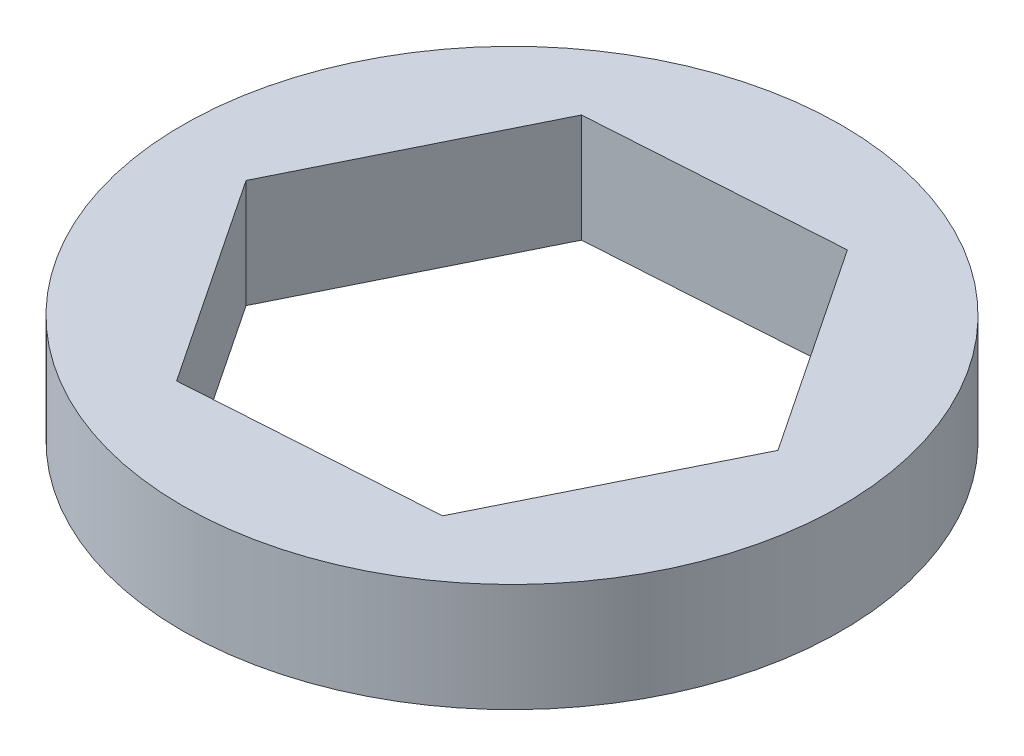
ISO-10303-21;
HEADER;
FILE_DESCRIPTION(('STEP AP214'),'2;1');
FILE_NAME('part.step','',(''),(''),'','','');
FILE_SCHEMA(('AUTOMOTIVE_DESIGN { 1 0 10303 214 1 1 1 1 }'));
ENDSEC;
DATA;
#1=APPLICATION_CONTEXT('core data for automotive mechanical design processes');
#2=APPLICATION_PROTOCOL_DEFINITION('international standard','automotive_design',2000,#1);
#3=PRODUCT_CONTEXT('',#1,'mechanical');
#4=PRODUCT('Part','Part','',(#3));
#5=PRODUCT_RELATED_PRODUCT_CATEGORY('part','',(#4));
#6=PRODUCT_DEFINITION_FORMATION('','',#4);
#7=PRODUCT_DEFINITION_CONTEXT('part definition',#1,'design');
#8=PRODUCT_DEFINITION('design','',#6,#7);
#9=PRODUCT_DEFINITION_SHAPE('','',#8);
#10=(LENGTH_UNIT() NAMED_UNIT(*) SI_UNIT(.MILLI.,.METRE.));
#11=(NAMED_UNIT(*) PLANE_ANGLE_UNIT() SI_UNIT($,.RADIAN.));
#12=(NAMED_UNIT(*) SI_UNIT($,.STERADIAN.) SOLID_ANGLE_UNIT());
#13=UNCERTAINTY_MEASURE_WITH_UNIT(LENGTH_MEASURE(1.E-05),#10,'distance_accuracy_value','');
#14=(GEOMETRIC_REPRESENTATION_CONTEXT(3) GLOBAL_UNCERTAINTY_ASSIGNED_CONTEXT((#13)) GLOBAL_UNIT_ASSIGNED_CONTEXT((#10,
#11,#12)) REPRESENTATION_CONTEXT('',''));
#15=CARTESIAN_POINT('',(0.,0.,0.));
#16=DIRECTION('',(0.,0.,1.));
#17=DIRECTION('',(1.,0.,0.));
#18=AXIS2_PLACEMENT_3D('',#15,#16,#17);
#19=CARTESIAN_POINT('',(0.,3.175,0.));
#20=DIRECTION('',(0.,1.,0.));
#21=DIRECTION('',(0.,0.,1.));
#22=AXIS2_PLACEMENT_3D('',#19,#20,#21);
#23=PLANE('',#22);
#24=CARTESIAN_POINT('',(0.,3.175,0.));
#25=DIRECTION('',(0.,1.,0.));
#26=DIRECTION('',(0.,0.,1.));
#27=AXIS2_PLACEMENT_3D('',#24,#25,#26);
#28=CIRCLE('',#27,9.652);
#29=CARTESIAN_POINT('',(0.,3.175,9.652));
#30=VERTEX_POINT('',#29);
#31=EDGE_CURVE('E11',#30,#30,#28,.T.);
#32=ORIENTED_EDGE('',*,*,#31,.T.);
#33=EDGE_LOOP('',(#32));
#34=FACE_BOUND('',#33,.T.);
#35=DIRECTION('',(0.443226594010271,0.,-0.896409608584186));
#36=VECTOR('',#35,1.);
#37=CARTESIAN_POINT('',(4.06725510664925,3.175,6.10088265997379));
#38=LINE('',#37,#36);
#39=CARTESIAN_POINT('',(4.06725510664925,3.175,6.10088265997379));
#40=VERTEX_POINT('',#39);
#41=CARTESIAN_POINT('',(7.31714692236991,3.175,-0.471904916043342));
#42=VERTEX_POINT('',#41);
#43=EDGE_CURVE('E96',#40,#42,#38,.T.);
#44=ORIENTED_EDGE('',*,*,#43,.F.);
#45=DIRECTION('',(0.997926790235506,0.,-0.064359314246346));
#46=VECTOR('',#45,1.);
#47=CARTESIAN_POINT('',(-3.24989181572066,3.175,6.57278757601714));
#48=LINE('',#47,#46);
#49=CARTESIAN_POINT('',(-3.24989181572066,3.175,6.57278757601714));
#50=VERTEX_POINT('',#49);
#51=EDGE_CURVE('E88',#50,#40,#48,.T.);
#52=ORIENTED_EDGE('',*,*,#51,.F.);
#53=DIRECTION('',(0.554700196225234,0.,0.83205029433784));
#54=VECTOR('',#53,1.);
#55=CARTESIAN_POINT('',(-7.31714692236991,3.175,0.471904916043342));
#56=LINE('',#55,#54);
#57=CARTESIAN_POINT('',(-7.31714692236991,3.175,0.471904916043343));
#58=VERTEX_POINT('',#57);
#59=EDGE_CURVE('E116',#58,#50,#56,.T.);
#60=ORIENTED_EDGE('',*,*,#59,.F.);
#61=DIRECTION('',(-0.443226594010272,0.,0.896409608584186));
#62=VECTOR('',#61,1.);
#63=CARTESIAN_POINT('',(-4.06725510664925,3.175,-6.10088265997379));
#64=LINE('',#63,#62);
#65=CARTESIAN_POINT('',(-4.06725510664925,3.175,-6.10088265997379));
#66=VERTEX_POINT('',#65);
#67=EDGE_CURVE('E114',#66,#58,#64,.T.);
#68=ORIENTED_EDGE('',*,*,#67,.F.);
#69=DIRECTION('',(-0.997926790235506,0.,0.0643593142463462));
#70=VECTOR('',#69,1.);
#71=CARTESIAN_POINT('',(3.24989181572066,3.175,-6.57278757601714));
#72=LINE('',#71,#70);
#73=CARTESIAN_POINT('',(3.24989181572066,3.175,-6.57278757601714));
#74=VERTEX_POINT('',#73);
#75=EDGE_CURVE('E110',#74,#66,#72,.T.);
#76=ORIENTED_EDGE('',*,*,#75,.F.);
#77=DIRECTION('',(-0.554700196225234,0.,-0.83205029433784));
#78=VECTOR('',#77,1.);
#79=CARTESIAN_POINT('',(7.31714692236991,3.175,-0.471904916043342));
#80=LINE('',#79,#78);
#81=EDGE_CURVE('E108',#42,#74,#80,.T.);
#82=ORIENTED_EDGE('',*,*,#81,.F.);
#83=EDGE_LOOP('',(#44,#52,#60,#68,#76,#82));
#84=FACE_BOUND('',#83,.T.);
#85=ADVANCED_FACE('F35',(#34,#84),#23,.T.);
#86=CARTESIAN_POINT('',(0.,0.,0.));
#87=DIRECTION('',(0.,1.,0.));
#88=DIRECTION('',(0.,0.,1.));
#89=AXIS2_PLACEMENT_3D('',#86,#87,#88);
#90=PLANE('',#89);
#91=CARTESIAN_POINT('',(0.,0.,0.));
#92=DIRECTION('',(0.,1.,0.));
#93=DIRECTION('',(0.,0.,1.));
#94=AXIS2_PLACEMENT_3D('',#91,#92,#93);
#95=CIRCLE('',#94,9.652);
#96=CARTESIAN_POINT('',(0.,0.,9.652));
#97=VERTEX_POINT('',#96);
#98=EDGE_CURVE('E39',#97,#97,#95,.T.);
#99=ORIENTED_EDGE('',*,*,#98,.F.);
#100=EDGE_LOOP('',(#99));
#101=FACE_BOUND('',#100,.T.);
#102=DIRECTION('',(0.997926790235506,0.,-0.064359314246346));
#103=VECTOR('',#102,1.);
#104=CARTESIAN_POINT('',(-3.24989181572066,0.,6.57278757601714));
#105=LINE('',#104,#103);
#106=CARTESIAN_POINT('',(-3.24989181572065,0.,6.57278757601714));
#107=VERTEX_POINT('',#106);
#108=CARTESIAN_POINT('',(4.06725510664925,0.,6.10088265997379));
#109=VERTEX_POINT('',#108);
#110=EDGE_CURVE('E58',#107,#109,#105,.T.);
#111=ORIENTED_EDGE('',*,*,#110,.T.);
#112=DIRECTION('',(0.443226594010271,0.,-0.896409608584186));
#113=VECTOR('',#112,1.);
#114=CARTESIAN_POINT('',(4.06725510664925,0.,6.10088265997379));
#115=LINE('',#114,#113);
#116=CARTESIAN_POINT('',(7.31714692236991,0.,-0.471904916043342));
#117=VERTEX_POINT('',#116);
#118=EDGE_CURVE('E103',#109,#117,#115,.T.);
#119=ORIENTED_EDGE('',*,*,#118,.T.);
#120=DIRECTION('',(-0.554700196225234,0.,-0.83205029433784));
#121=VECTOR('',#120,1.);
#122=CARTESIAN_POINT('',(7.31714692236991,0.,-0.471904916043342));
#123=LINE('',#122,#121);
#124=CARTESIAN_POINT('',(3.24989181572066,0.,-6.57278757601714));
#125=VERTEX_POINT('',#124);
#126=EDGE_CURVE('E120',#117,#125,#123,.T.);
#127=ORIENTED_EDGE('',*,*,#126,.T.);
#128=DIRECTION('',(-0.997926790235506,0.,0.0643593142463462));
#129=VECTOR('',#128,1.);
#130=CARTESIAN_POINT('',(3.24989181572066,0.,-6.57278757601714));
#131=LINE('',#130,#129);
#132=CARTESIAN_POINT('',(-4.06725510664925,0.,-6.10088265997379));
#133=VERTEX_POINT('',#132);
#134=EDGE_CURVE('E123',#125,#133,#131,.T.);
#135=ORIENTED_EDGE('',*,*,#134,.T.);
#136=DIRECTION('',(-0.443226594010272,0.,0.896409608584186));
#137=VECTOR('',#136,1.);
#138=CARTESIAN_POINT('',(-4.06725510664925,0.,-6.10088265997379));
#139=LINE('',#138,#137);
#140=CARTESIAN_POINT('',(-7.31714692236991,0.,0.471904916043342));
#141=VERTEX_POINT('',#140);
#142=EDGE_CURVE('E126',#133,#141,#139,.T.);
#143=ORIENTED_EDGE('',*,*,#142,.T.);
#144=DIRECTION('',(0.554700196225234,0.,0.83205029433784));
#145=VECTOR('',#144,1.);
#146=CARTESIAN_POINT('',(-7.31714692236991,0.,0.471904916043342));
#147=LINE('',#146,#145);
#148=EDGE_CURVE('E97',#141,#107,#147,.T.);
#149=ORIENTED_EDGE('',*,*,#148,.T.);
#150=EDGE_LOOP('',(#111,#119,#127,#135,#143,#149));
#151=FACE_BOUND('',#150,.T.);
#152=ADVANCED_FACE('F143',(#101,#151),#90,.F.);
#153=CARTESIAN_POINT('',(0.,3.175,0.));
#154=DIRECTION('',(0.,-1.,0.));
#155=DIRECTION('',(0.,0.,-1.));
#156=AXIS2_PLACEMENT_3D('',#153,#154,#155);
#157=CYLINDRICAL_SURFACE('',#156,9.652);
#158=ORIENTED_EDGE('',*,*,#31,.F.);
#159=EDGE_LOOP('',(#158));
#160=FACE_BOUND('',#159,.T.);
#161=ORIENTED_EDGE('',*,*,#98,.T.);
#162=EDGE_LOOP('',(#161));
#163=FACE_BOUND('',#162,.T.);
#164=ADVANCED_FACE('F37',(#160,#163),#157,.T.);
#165=CARTESIAN_POINT('',(-3.24989181572066,3.175,6.57278757601714));
#166=DIRECTION('',(-0.064359314246346,0.,-0.997926790235506));
#167=DIRECTION('',(-0.997926790235506,0.,0.064359314246346));
#168=AXIS2_PLACEMENT_3D('',#165,#166,#167);
#169=PLANE('',#168);
#170=ORIENTED_EDGE('',*,*,#110,.F.);
#171=DIRECTION('',(0.,-1.,0.));
#172=VECTOR('',#171,1.);
#173=CARTESIAN_POINT('',(-3.24989181572066,3.175,6.57278757601714));
#174=LINE('',#173,#172);
#175=EDGE_CURVE('E92',#50,#107,#174,.T.);
#176=ORIENTED_EDGE('',*,*,#175,.F.);
#177=ORIENTED_EDGE('',*,*,#51,.T.);
#178=DIRECTION('',(0.,-1.,0.));
#179=VECTOR('',#178,1.);
#180=CARTESIAN_POINT('',(4.06725510664925,3.175,6.10088265997379));
#181=LINE('',#180,#179);
#182=EDGE_CURVE('E91',#40,#109,#181,.T.);
#183=ORIENTED_EDGE('',*,*,#182,.T.);
#184=EDGE_LOOP('',(#170,#176,#177,#183));
#185=FACE_BOUND('',#184,.T.);
#186=ADVANCED_FACE('F90',(#185),#169,.T.);
#187=CARTESIAN_POINT('',(4.06725510664925,3.175,6.10088265997379));
#188=DIRECTION('',(-0.896409608584186,0.,-0.443226594010271));
#189=DIRECTION('',(-0.443226594010272,0.,0.896409608584186));
#190=AXIS2_PLACEMENT_3D('',#187,#188,#189);
#191=PLANE('',#190);
#192=ORIENTED_EDGE('',*,*,#118,.F.);
#193=ORIENTED_EDGE('',*,*,#182,.F.);
#194=ORIENTED_EDGE('',*,*,#43,.T.);
#195=DIRECTION('',(0.,-1.,0.));
#196=VECTOR('',#195,1.);
#197=CARTESIAN_POINT('',(7.31714692236991,3.175,-0.471904916043342));
#198=LINE('',#197,#196);
#199=EDGE_CURVE('E104',#42,#117,#198,.T.);
#200=ORIENTED_EDGE('',*,*,#199,.T.);
#201=EDGE_LOOP('',(#192,#193,#194,#200));
#202=FACE_BOUND('',#201,.T.);
#203=ADVANCED_FACE('F100',(#202),#191,.T.);
#204=CARTESIAN_POINT('',(7.31714692236991,3.175,-0.471904916043342));
#205=DIRECTION('',(-0.83205029433784,0.,0.554700196225235));
#206=DIRECTION('',(0.554700196225235,0.,0.83205029433784));
#207=AXIS2_PLACEMENT_3D('',#204,#205,#206);
#208=PLANE('',#207);
#209=ORIENTED_EDGE('',*,*,#126,.F.);
#210=ORIENTED_EDGE('',*,*,#199,.F.);
#211=ORIENTED_EDGE('',*,*,#81,.T.);
#212=DIRECTION('',(0.,-1.,0.));
#213=VECTOR('',#212,1.);
#214=CARTESIAN_POINT('',(3.24989181572066,3.175,-6.57278757601714));
#215=LINE('',#214,#213);
#216=EDGE_CURVE('E135',#74,#125,#215,.T.);
#217=ORIENTED_EDGE('',*,*,#216,.T.);
#218=EDGE_LOOP('',(#209,#210,#211,#217));
#219=FACE_BOUND('',#218,.T.);
#220=ADVANCED_FACE('F139',(#219),#208,.T.);
#221=CARTESIAN_POINT('',(3.24989181572066,3.175,-6.57278757601714));
#222=DIRECTION('',(0.0643593142463462,0.,0.997926790235506));
#223=DIRECTION('',(0.997926790235506,0.,-0.0643593142463462));
#224=AXIS2_PLACEMENT_3D('',#221,#222,#223);
#225=PLANE('',#224);
#226=ORIENTED_EDGE('',*,*,#134,.F.);
#227=ORIENTED_EDGE('',*,*,#216,.F.);
#228=ORIENTED_EDGE('',*,*,#75,.T.);
#229=DIRECTION('',(0.,-1.,0.));
#230=VECTOR('',#229,1.);
#231=CARTESIAN_POINT('',(-4.06725510664925,3.175,-6.10088265997379));
#232=LINE('',#231,#230);
#233=EDGE_CURVE('E133',#66,#133,#232,.T.);
#234=ORIENTED_EDGE('',*,*,#233,.T.);
#235=EDGE_LOOP('',(#226,#227,#228,#234));
#236=FACE_BOUND('',#235,.T.);
#237=ADVANCED_FACE('F151',(#236),#225,.T.);
#238=CARTESIAN_POINT('',(-4.06725510664925,3.175,-6.10088265997379));
#239=DIRECTION('',(0.896409608584186,0.,0.443226594010272));
#240=DIRECTION('',(0.443226594010272,0.,-0.896409608584186));
#241=AXIS2_PLACEMENT_3D('',#238,#239,#240);
#242=PLANE('',#241);
#243=ORIENTED_EDGE('',*,*,#142,.F.);
#244=ORIENTED_EDGE('',*,*,#233,.F.);
#245=ORIENTED_EDGE('',*,*,#67,.T.);
#246=DIRECTION('',(0.,-1.,0.));
#247=VECTOR('',#246,1.);
#248=CARTESIAN_POINT('',(-7.31714692236991,3.175,0.471904916043342));
#249=LINE('',#248,#247);
#250=EDGE_CURVE('E50',#58,#141,#249,.T.);
#251=ORIENTED_EDGE('',*,*,#250,.T.);
#252=EDGE_LOOP('',(#243,#244,#245,#251));
#253=FACE_BOUND('',#252,.T.);
#254=ADVANCED_FACE('F149',(#253),#242,.T.);
#255=CARTESIAN_POINT('',(-7.31714692236991,3.175,0.471904916043342));
#256=DIRECTION('',(0.83205029433784,0.,-0.554700196225234));
#257=DIRECTION('',(-0.554700196225234,0.,-0.83205029433784));
#258=AXIS2_PLACEMENT_3D('',#255,#256,#257);
#259=PLANE('',#258);
#260=ORIENTED_EDGE('',*,*,#148,.F.);
#261=ORIENTED_EDGE('',*,*,#250,.F.);
#262=ORIENTED_EDGE('',*,*,#59,.T.);
#263=ORIENTED_EDGE('',*,*,#175,.T.);
#264=EDGE_LOOP('',(#260,#261,#262,#263));
#265=FACE_BOUND('',#264,.T.);
#266=ADVANCED_FACE('F145',(#265),#259,.T.);
#267=CLOSED_SHELL('',(#85,#152,#164,#186,#203,#220,#237,#254,#266));
#268=MANIFOLD_SOLID_BREP('B2',#267);
#269=ADVANCED_BREP_SHAPE_REPRESENTATION('',(#18,#268),#14);
#270=SHAPE_DEFINITION_REPRESENTATION(#9,#269);
ENDSEC;
END-ISO-10303-21;
